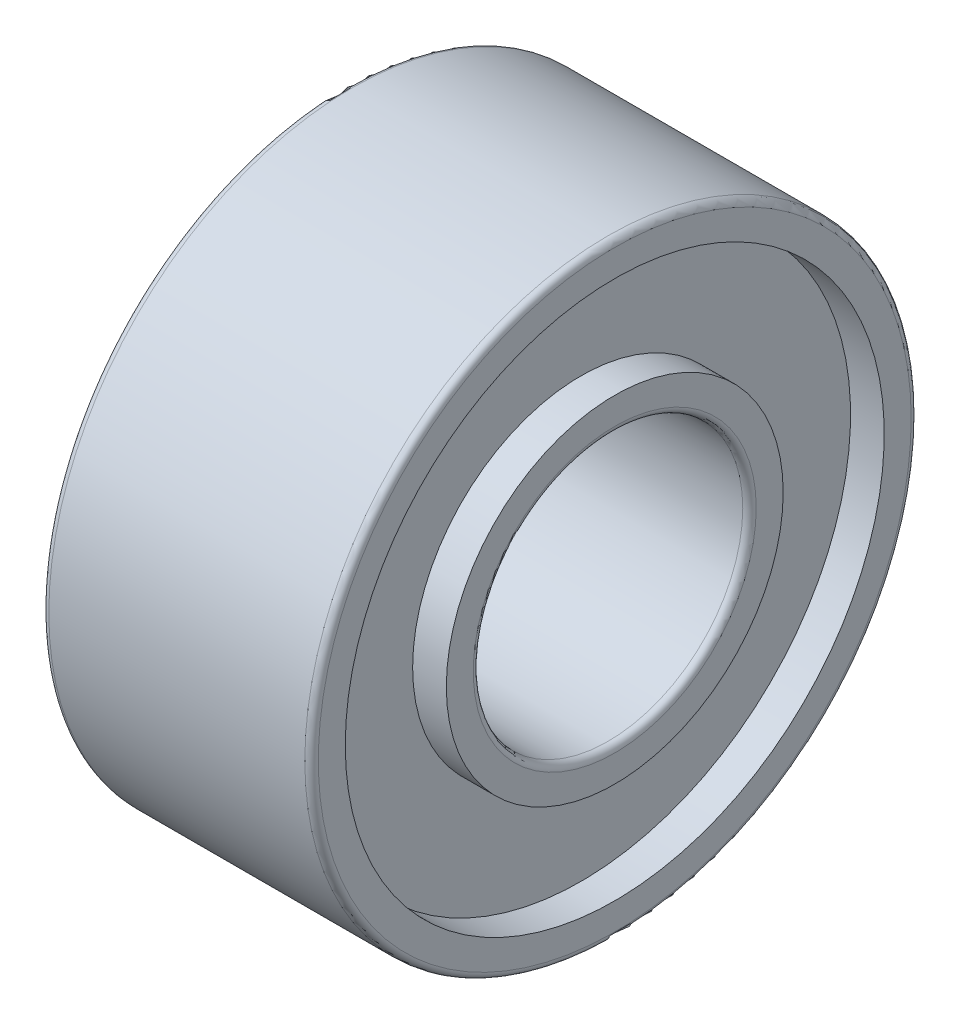
ISO-10303-21;
HEADER;
FILE_DESCRIPTION(('STEP AP214'),'2;1');
FILE_NAME('part.step','',(''),(''),'','','');
FILE_SCHEMA(('AUTOMOTIVE_DESIGN { 1 0 10303 214 1 1 1 1 }'));
ENDSEC;
DATA;
#1=APPLICATION_CONTEXT('core data for automotive mechanical design processes');
#2=APPLICATION_PROTOCOL_DEFINITION('international standard','automotive_design',2000,#1);
#3=PRODUCT_CONTEXT('',#1,'mechanical');
#4=PRODUCT('Part','Part','',(#3));
#5=PRODUCT_RELATED_PRODUCT_CATEGORY('part','',(#4));
#6=PRODUCT_DEFINITION_FORMATION('','',#4);
#7=PRODUCT_DEFINITION_CONTEXT('part definition',#1,'design');
#8=PRODUCT_DEFINITION('design','',#6,#7);
#9=PRODUCT_DEFINITION_SHAPE('','',#8);
#10=(LENGTH_UNIT() NAMED_UNIT(*) SI_UNIT(.MILLI.,.METRE.));
#11=(NAMED_UNIT(*) PLANE_ANGLE_UNIT() SI_UNIT($,.RADIAN.));
#12=(NAMED_UNIT(*) SI_UNIT($,.STERADIAN.) SOLID_ANGLE_UNIT());
#13=UNCERTAINTY_MEASURE_WITH_UNIT(LENGTH_MEASURE(1.E-05),#10,'distance_accuracy_value','');
#14=(GEOMETRIC_REPRESENTATION_CONTEXT(3) GLOBAL_UNCERTAINTY_ASSIGNED_CONTEXT((#13)) GLOBAL_UNIT_ASSIGNED_CONTEXT((#10,
#11,#12)) REPRESENTATION_CONTEXT('',''));
#15=CARTESIAN_POINT('',(0.,0.,0.));
#16=DIRECTION('',(0.,0.,1.));
#17=DIRECTION('',(1.,0.,0.));
#18=AXIS2_PLACEMENT_3D('',#15,#16,#17);
#19=CARTESIAN_POINT('',(4.,0.,0.));
#20=DIRECTION('',(-1.,0.,0.));
#21=DIRECTION('',(0.,0.,1.));
#22=AXIS2_PLACEMENT_3D('',#19,#20,#21);
#23=CYLINDRICAL_SURFACE('',#22,2.);
#24=CARTESIAN_POINT('',(0.0999999999999998,0.,0.));
#25=DIRECTION('',(1.,0.,0.));
#26=DIRECTION('',(0.,0.,-1.));
#27=AXIS2_PLACEMENT_3D('',#24,#25,#26);
#28=CIRCLE('',#27,2.);
#29=CARTESIAN_POINT('',(0.0999999999999998,0.,-2.));
#30=VERTEX_POINT('',#29);
#31=EDGE_CURVE('E163',#30,#30,#28,.T.);
#32=ORIENTED_EDGE('',*,*,#31,.F.);
#33=EDGE_LOOP('',(#32));
#34=FACE_BOUND('',#33,.T.);
#35=CARTESIAN_POINT('',(3.9,0.,0.));
#36=DIRECTION('',(1.,0.,0.));
#37=DIRECTION('',(0.,0.,-1.));
#38=AXIS2_PLACEMENT_3D('',#35,#36,#37);
#39=CIRCLE('',#38,2.);
#40=CARTESIAN_POINT('',(3.9,0.,-2.));
#41=VERTEX_POINT('',#40);
#42=EDGE_CURVE('E142',#41,#41,#39,.F.);
#43=ORIENTED_EDGE('',*,*,#42,.F.);
#44=EDGE_LOOP('',(#43));
#45=FACE_BOUND('',#44,.T.);
#46=ADVANCED_FACE('F14',(#34,#45),#23,.F.);
#47=CARTESIAN_POINT('',(0.0999999999999998,0.,0.));
#48=DIRECTION('',(1.,0.,0.));
#49=DIRECTION('',(0.,0.,-1.));
#50=AXIS2_PLACEMENT_3D('',#47,#48,#49);
#51=TOROIDAL_SURFACE('',#50,2.1,0.0999999999999998);
#52=CARTESIAN_POINT('',(0.,0.,0.));
#53=DIRECTION('',(-1.,0.,0.));
#54=DIRECTION('',(0.,0.,-1.));
#55=AXIS2_PLACEMENT_3D('',#52,#53,#54);
#56=CIRCLE('',#55,2.1);
#57=CARTESIAN_POINT('',(0.,0.,-2.1));
#58=VERTEX_POINT('',#57);
#59=EDGE_CURVE('E131',#58,#58,#56,.F.);
#60=ORIENTED_EDGE('',*,*,#59,.F.);
#61=EDGE_LOOP('',(#60));
#62=FACE_BOUND('',#61,.T.);
#63=ORIENTED_EDGE('',*,*,#31,.T.);
#64=EDGE_LOOP('',(#63));
#65=FACE_BOUND('',#64,.T.);
#66=ADVANCED_FACE('F147',(#62,#65),#51,.T.);
#67=CARTESIAN_POINT('',(3.9,0.,0.));
#68=DIRECTION('',(1.,0.,0.));
#69=DIRECTION('',(0.,0.,-1.));
#70=AXIS2_PLACEMENT_3D('',#67,#68,#69);
#71=TOROIDAL_SURFACE('',#70,2.1,0.1);
#72=ORIENTED_EDGE('',*,*,#42,.T.);
#73=EDGE_LOOP('',(#72));
#74=FACE_BOUND('',#73,.T.);
#75=CARTESIAN_POINT('',(4.,0.,0.));
#76=DIRECTION('',(1.,0.,0.));
#77=DIRECTION('',(0.,0.,-1.));
#78=AXIS2_PLACEMENT_3D('',#75,#76,#77);
#79=CIRCLE('',#78,2.1);
#80=CARTESIAN_POINT('',(4.,0.,-2.1));
#81=VERTEX_POINT('',#80);
#82=EDGE_CURVE('E208',#81,#81,#79,.F.);
#83=ORIENTED_EDGE('',*,*,#82,.F.);
#84=EDGE_LOOP('',(#83));
#85=FACE_BOUND('',#84,.T.);
#86=ADVANCED_FACE('F144',(#74,#85),#71,.T.);
#87=CARTESIAN_POINT('',(0.,2.5,0.));
#88=DIRECTION('',(-1.,0.,0.));
#89=DIRECTION('',(0.,0.,1.));
#90=AXIS2_PLACEMENT_3D('',#87,#88,#89);
#91=PLANE('',#90);
#92=CARTESIAN_POINT('',(0.,0.,0.));
#93=DIRECTION('',(-1.,0.,0.));
#94=DIRECTION('',(0.,0.,1.));
#95=AXIS2_PLACEMENT_3D('',#92,#93,#94);
#96=CIRCLE('',#95,2.5);
#97=CARTESIAN_POINT('',(0.,0.,2.5));
#98=VERTEX_POINT('',#97);
#99=EDGE_CURVE('E17',#98,#98,#96,.F.);
#100=ORIENTED_EDGE('',*,*,#99,.F.);
#101=EDGE_LOOP('',(#100));
#102=FACE_BOUND('',#101,.T.);
#103=ORIENTED_EDGE('',*,*,#59,.T.);
#104=EDGE_LOOP('',(#103));
#105=FACE_BOUND('',#104,.T.);
#106=ADVANCED_FACE('F112',(#102,#105),#91,.T.);
#107=CARTESIAN_POINT('',(4.,2.1,0.));
#108=DIRECTION('',(1.,0.,0.));
#109=DIRECTION('',(0.,0.,-1.));
#110=AXIS2_PLACEMENT_3D('',#107,#108,#109);
#111=PLANE('',#110);
#112=ORIENTED_EDGE('',*,*,#82,.T.);
#113=EDGE_LOOP('',(#112));
#114=FACE_BOUND('',#113,.T.);
#115=CARTESIAN_POINT('',(4.,0.,0.));
#116=DIRECTION('',(-1.,0.,0.));
#117=DIRECTION('',(0.,0.,1.));
#118=AXIS2_PLACEMENT_3D('',#115,#116,#117);
#119=CIRCLE('',#118,2.5);
#120=CARTESIAN_POINT('',(4.,0.,2.5));
#121=VERTEX_POINT('',#120);
#122=EDGE_CURVE('E202',#121,#121,#119,.T.);
#123=ORIENTED_EDGE('',*,*,#122,.F.);
#124=EDGE_LOOP('',(#123));
#125=FACE_BOUND('',#124,.T.);
#126=ADVANCED_FACE('F107',(#114,#125),#111,.T.);
#127=CARTESIAN_POINT('',(4.,0.,0.));
#128=DIRECTION('',(-1.,0.,0.));
#129=DIRECTION('',(0.,0.,1.));
#130=AXIS2_PLACEMENT_3D('',#127,#128,#129);
#131=CYLINDRICAL_SURFACE('',#130,2.5);
#132=CARTESIAN_POINT('',(0.5,0.,0.));
#133=DIRECTION('',(-1.,0.,0.));
#134=DIRECTION('',(0.,0.,1.));
#135=AXIS2_PLACEMENT_3D('',#132,#133,#134);
#136=CIRCLE('',#135,2.5);
#137=CARTESIAN_POINT('',(0.5,0.,2.5));
#138=VERTEX_POINT('',#137);
#139=EDGE_CURVE('E199',#138,#138,#136,.F.);
#140=ORIENTED_EDGE('',*,*,#139,.F.);
#141=EDGE_LOOP('',(#140));
#142=FACE_BOUND('',#141,.T.);
#143=ORIENTED_EDGE('',*,*,#99,.T.);
#144=EDGE_LOOP('',(#143));
#145=FACE_BOUND('',#144,.T.);
#146=ADVANCED_FACE('F103',(#142,#145),#131,.T.);
#147=CARTESIAN_POINT('',(4.,0.,0.));
#148=DIRECTION('',(-1.,0.,0.));
#149=DIRECTION('',(0.,0.,1.));
#150=AXIS2_PLACEMENT_3D('',#147,#148,#149);
#151=CYLINDRICAL_SURFACE('',#150,2.5);
#152=ORIENTED_EDGE('',*,*,#122,.T.);
#153=EDGE_LOOP('',(#152));
#154=FACE_BOUND('',#153,.T.);
#155=CARTESIAN_POINT('',(3.5,0.,0.));
#156=DIRECTION('',(-1.,0.,0.));
#157=DIRECTION('',(0.,0.,1.));
#158=AXIS2_PLACEMENT_3D('',#155,#156,#157);
#159=CIRCLE('',#158,2.5);
#160=CARTESIAN_POINT('',(3.5,0.,2.5));
#161=VERTEX_POINT('',#160);
#162=EDGE_CURVE('E195',#161,#161,#159,.T.);
#163=ORIENTED_EDGE('',*,*,#162,.F.);
#164=EDGE_LOOP('',(#163));
#165=FACE_BOUND('',#164,.T.);
#166=ADVANCED_FACE('F99',(#154,#165),#151,.T.);
#167=CARTESIAN_POINT('',(0.5,4.,0.));
#168=DIRECTION('',(-1.,0.,0.));
#169=DIRECTION('',(0.,0.,1.));
#170=AXIS2_PLACEMENT_3D('',#167,#168,#169);
#171=PLANE('',#170);
#172=CARTESIAN_POINT('',(0.5,0.,0.));
#173=DIRECTION('',(-1.,0.,0.));
#174=DIRECTION('',(0.,0.,1.));
#175=AXIS2_PLACEMENT_3D('',#172,#173,#174);
#176=CIRCLE('',#175,4.);
#177=CARTESIAN_POINT('',(0.5,0.,4.));
#178=VERTEX_POINT('',#177);
#179=EDGE_CURVE('E191',#178,#178,#176,.T.);
#180=ORIENTED_EDGE('',*,*,#179,.T.);
#181=EDGE_LOOP('',(#180));
#182=FACE_BOUND('',#181,.T.);
#183=ORIENTED_EDGE('',*,*,#139,.T.);
#184=EDGE_LOOP('',(#183));
#185=FACE_BOUND('',#184,.T.);
#186=ADVANCED_FACE('F95',(#182,#185),#171,.T.);
#187=CARTESIAN_POINT('',(3.5,2.5,0.));
#188=DIRECTION('',(1.,0.,0.));
#189=DIRECTION('',(0.,0.,-1.));
#190=AXIS2_PLACEMENT_3D('',#187,#188,#189);
#191=PLANE('',#190);
#192=ORIENTED_EDGE('',*,*,#162,.T.);
#193=EDGE_LOOP('',(#192));
#194=FACE_BOUND('',#193,.T.);
#195=CARTESIAN_POINT('',(3.5,0.,0.));
#196=DIRECTION('',(-1.,0.,0.));
#197=DIRECTION('',(0.,0.,1.));
#198=AXIS2_PLACEMENT_3D('',#195,#196,#197);
#199=CIRCLE('',#198,4.);
#200=CARTESIAN_POINT('',(3.5,0.,4.));
#201=VERTEX_POINT('',#200);
#202=EDGE_CURVE('E187',#201,#201,#199,.F.);
#203=ORIENTED_EDGE('',*,*,#202,.T.);
#204=EDGE_LOOP('',(#203));
#205=FACE_BOUND('',#204,.T.);
#206=ADVANCED_FACE('F91',(#194,#205),#191,.T.);
#207=CARTESIAN_POINT('',(4.,0.,0.));
#208=DIRECTION('',(-1.,0.,0.));
#209=DIRECTION('',(0.,0.,1.));
#210=AXIS2_PLACEMENT_3D('',#207,#208,#209);
#211=CYLINDRICAL_SURFACE('',#210,4.);
#212=CARTESIAN_POINT('',(0.,0.,0.));
#213=DIRECTION('',(-1.,0.,0.));
#214=DIRECTION('',(0.,0.,1.));
#215=AXIS2_PLACEMENT_3D('',#212,#213,#214);
#216=CIRCLE('',#215,4.);
#217=CARTESIAN_POINT('',(0.,0.,4.));
#218=VERTEX_POINT('',#217);
#219=EDGE_CURVE('E183',#218,#218,#216,.F.);
#220=ORIENTED_EDGE('',*,*,#219,.F.);
#221=EDGE_LOOP('',(#220));
#222=FACE_BOUND('',#221,.T.);
#223=ORIENTED_EDGE('',*,*,#179,.F.);
#224=EDGE_LOOP('',(#223));
#225=FACE_BOUND('',#224,.T.);
#226=ADVANCED_FACE('F87',(#222,#225),#211,.F.);
#227=CARTESIAN_POINT('',(4.,0.,0.));
#228=DIRECTION('',(-1.,0.,0.));
#229=DIRECTION('',(0.,0.,1.));
#230=AXIS2_PLACEMENT_3D('',#227,#228,#229);
#231=CYLINDRICAL_SURFACE('',#230,4.);
#232=ORIENTED_EDGE('',*,*,#202,.F.);
#233=EDGE_LOOP('',(#232));
#234=FACE_BOUND('',#233,.T.);
#235=CARTESIAN_POINT('',(4.,0.,0.));
#236=DIRECTION('',(-1.,0.,0.));
#237=DIRECTION('',(0.,0.,1.));
#238=AXIS2_PLACEMENT_3D('',#235,#236,#237);
#239=CIRCLE('',#238,4.);
#240=CARTESIAN_POINT('',(4.,0.,4.));
#241=VERTEX_POINT('',#240);
#242=EDGE_CURVE('E174',#241,#241,#239,.T.);
#243=ORIENTED_EDGE('',*,*,#242,.F.);
#244=EDGE_LOOP('',(#243));
#245=FACE_BOUND('',#244,.T.);
#246=ADVANCED_FACE('F83',(#234,#245),#231,.F.);
#247=CARTESIAN_POINT('',(0.,4.4,0.));
#248=DIRECTION('',(-1.,0.,0.));
#249=DIRECTION('',(0.,0.,1.));
#250=AXIS2_PLACEMENT_3D('',#247,#248,#249);
#251=PLANE('',#250);
#252=CARTESIAN_POINT('',(0.,0.,0.));
#253=DIRECTION('',(1.,0.,0.));
#254=DIRECTION('',(0.,0.,-1.));
#255=AXIS2_PLACEMENT_3D('',#252,#253,#254);
#256=CIRCLE('',#255,4.4);
#257=CARTESIAN_POINT('',(0.,0.,-4.4));
#258=VERTEX_POINT('',#257);
#259=EDGE_CURVE('E67',#258,#258,#256,.T.);
#260=ORIENTED_EDGE('',*,*,#259,.F.);
#261=EDGE_LOOP('',(#260));
#262=FACE_BOUND('',#261,.T.);
#263=ORIENTED_EDGE('',*,*,#219,.T.);
#264=EDGE_LOOP('',(#263));
#265=FACE_BOUND('',#264,.T.);
#266=ADVANCED_FACE('F73',(#262,#265),#251,.T.);
#267=CARTESIAN_POINT('',(4.,4.,0.));
#268=DIRECTION('',(1.,0.,0.));
#269=DIRECTION('',(0.,0.,-1.));
#270=AXIS2_PLACEMENT_3D('',#267,#268,#269);
#271=PLANE('',#270);
#272=ORIENTED_EDGE('',*,*,#242,.T.);
#273=EDGE_LOOP('',(#272));
#274=FACE_BOUND('',#273,.T.);
#275=CARTESIAN_POINT('',(4.,0.,0.));
#276=DIRECTION('',(-1.,0.,0.));
#277=DIRECTION('',(0.,0.,-1.));
#278=AXIS2_PLACEMENT_3D('',#275,#276,#277);
#279=CIRCLE('',#278,4.4);
#280=CARTESIAN_POINT('',(4.,0.,-4.4));
#281=VERTEX_POINT('',#280);
#282=EDGE_CURVE('E29',#281,#281,#279,.T.);
#283=ORIENTED_EDGE('',*,*,#282,.F.);
#284=EDGE_LOOP('',(#283));
#285=FACE_BOUND('',#284,.T.);
#286=ADVANCED_FACE('F82',(#274,#285),#271,.T.);
#287=CARTESIAN_POINT('',(0.1,0.,0.));
#288=DIRECTION('',(1.,0.,0.));
#289=DIRECTION('',(0.,0.,-1.));
#290=AXIS2_PLACEMENT_3D('',#287,#288,#289);
#291=TOROIDAL_SURFACE('',#290,4.4,0.1);
#292=CARTESIAN_POINT('',(0.0999999999999998,0.,0.));
#293=DIRECTION('',(-1.,0.,0.));
#294=DIRECTION('',(0.,0.,1.));
#295=AXIS2_PLACEMENT_3D('',#292,#293,#294);
#296=CIRCLE('',#295,4.5);
#297=CARTESIAN_POINT('',(0.0999999999999998,0.,4.5));
#298=VERTEX_POINT('',#297);
#299=EDGE_CURVE('E22',#298,#298,#296,.F.);
#300=ORIENTED_EDGE('',*,*,#299,.F.);
#301=EDGE_LOOP('',(#300));
#302=FACE_BOUND('',#301,.T.);
#303=ORIENTED_EDGE('',*,*,#259,.T.);
#304=EDGE_LOOP('',(#303));
#305=FACE_BOUND('',#304,.T.);
#306=ADVANCED_FACE('F47',(#302,#305),#291,.T.);
#307=CARTESIAN_POINT('',(3.9,0.,0.));
#308=DIRECTION('',(1.,0.,0.));
#309=DIRECTION('',(0.,0.,-1.));
#310=AXIS2_PLACEMENT_3D('',#307,#308,#309);
#311=TOROIDAL_SURFACE('',#310,4.4,0.1);
#312=ORIENTED_EDGE('',*,*,#282,.T.);
#313=EDGE_LOOP('',(#312));
#314=FACE_BOUND('',#313,.T.);
#315=CARTESIAN_POINT('',(3.9,0.,0.));
#316=DIRECTION('',(-1.,0.,0.));
#317=DIRECTION('',(0.,0.,1.));
#318=AXIS2_PLACEMENT_3D('',#315,#316,#317);
#319=CIRCLE('',#318,4.5);
#320=CARTESIAN_POINT('',(3.9,0.,4.5));
#321=VERTEX_POINT('',#320);
#322=EDGE_CURVE('E9',#321,#321,#319,.T.);
#323=ORIENTED_EDGE('',*,*,#322,.F.);
#324=EDGE_LOOP('',(#323));
#325=FACE_BOUND('',#324,.T.);
#326=ADVANCED_FACE('F41',(#314,#325),#311,.T.);
#327=CARTESIAN_POINT('',(4.,0.,0.));
#328=DIRECTION('',(-1.,0.,0.));
#329=DIRECTION('',(0.,0.,1.));
#330=AXIS2_PLACEMENT_3D('',#327,#328,#329);
#331=CYLINDRICAL_SURFACE('',#330,4.5);
#332=ORIENTED_EDGE('',*,*,#322,.T.);
#333=EDGE_LOOP('',(#332));
#334=FACE_BOUND('',#333,.T.);
#335=ORIENTED_EDGE('',*,*,#299,.T.);
#336=EDGE_LOOP('',(#335));
#337=FACE_BOUND('',#336,.T.);
#338=ADVANCED_FACE('F46',(#334,#337),#331,.T.);
#339=CLOSED_SHELL('',(#46,#66,#86,#106,#126,#146,#166,#186,#206,#226,#246,#266,#286,#306,#326,#338));
#340=MANIFOLD_SOLID_BREP('B1',#339);
#341=ADVANCED_BREP_SHAPE_REPRESENTATION('',(#18,#340),#14);
#342=SHAPE_DEFINITION_REPRESENTATION(#9,#341);
ENDSEC;
END-ISO-10303-21;
